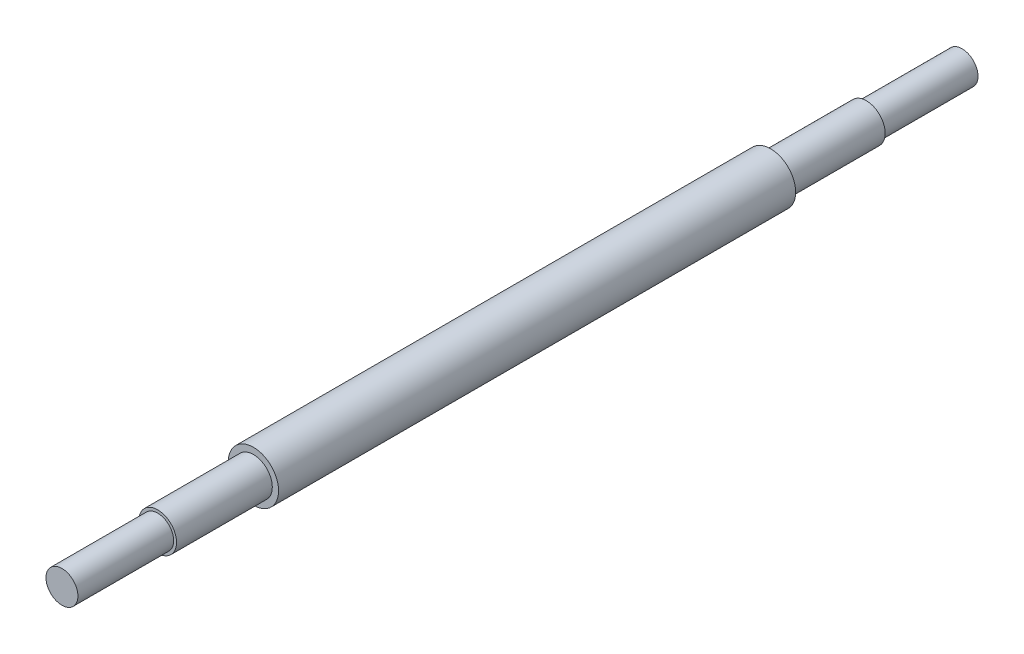
ISO-10303-21;
HEADER;
FILE_DESCRIPTION(('STEP AP214'),'2;1');
FILE_NAME('part.step','',(''),(''),'','','');
FILE_SCHEMA(('AUTOMOTIVE_DESIGN { 1 0 10303 214 1 1 1 1 }'));
ENDSEC;
DATA;
#1=APPLICATION_CONTEXT('core data for automotive mechanical design processes');
#2=APPLICATION_PROTOCOL_DEFINITION('international standard','automotive_design',2000,#1);
#3=PRODUCT_CONTEXT('',#1,'mechanical');
#4=PRODUCT('Part','Part','',(#3));
#5=PRODUCT_RELATED_PRODUCT_CATEGORY('part','',(#4));
#6=PRODUCT_DEFINITION_FORMATION('','',#4);
#7=PRODUCT_DEFINITION_CONTEXT('part definition',#1,'design');
#8=PRODUCT_DEFINITION('design','',#6,#7);
#9=PRODUCT_DEFINITION_SHAPE('','',#8);
#10=(LENGTH_UNIT() NAMED_UNIT(*) SI_UNIT(.MILLI.,.METRE.));
#11=(NAMED_UNIT(*) PLANE_ANGLE_UNIT() SI_UNIT($,.RADIAN.));
#12=(NAMED_UNIT(*) SI_UNIT($,.STERADIAN.) SOLID_ANGLE_UNIT());
#13=UNCERTAINTY_MEASURE_WITH_UNIT(LENGTH_MEASURE(1.E-05),#10,'distance_accuracy_value','');
#14=(GEOMETRIC_REPRESENTATION_CONTEXT(3) GLOBAL_UNCERTAINTY_ASSIGNED_CONTEXT((#13)) GLOBAL_UNIT_ASSIGNED_CONTEXT((#10,
#11,#12)) REPRESENTATION_CONTEXT('',''));
#15=CARTESIAN_POINT('',(0.,0.,0.));
#16=DIRECTION('',(0.,0.,1.));
#17=DIRECTION('',(1.,0.,0.));
#18=AXIS2_PLACEMENT_3D('',#15,#16,#17);
#19=CARTESIAN_POINT('',(0.,0.,-411.48));
#20=DIRECTION('',(0.,0.,1.));
#21=DIRECTION('',(1.,0.,0.));
#22=AXIS2_PLACEMENT_3D('',#19,#20,#21);
#23=CYLINDRICAL_SURFACE('',#22,20.);
#24=CARTESIAN_POINT('',(0.,0.,-411.48));
#25=DIRECTION('',(0.,0.,1.));
#26=DIRECTION('',(1.,0.,0.));
#27=AXIS2_PLACEMENT_3D('',#24,#25,#26);
#28=CIRCLE('',#27,20.);
#29=CARTESIAN_POINT('',(20.,0.,-411.48));
#30=VERTEX_POINT('',#29);
#31=EDGE_CURVE('E66',#30,#30,#28,.T.);
#32=ORIENTED_EDGE('',*,*,#31,.T.);
#33=EDGE_LOOP('',(#32));
#34=FACE_BOUND('',#33,.T.);
#35=CARTESIAN_POINT('',(0.,0.,0.));
#36=DIRECTION('',(0.,0.,1.));
#37=DIRECTION('',(1.,0.,0.));
#38=AXIS2_PLACEMENT_3D('',#35,#36,#37);
#39=CIRCLE('',#38,20.);
#40=CARTESIAN_POINT('',(20.,0.,0.));
#41=VERTEX_POINT('',#40);
#42=EDGE_CURVE('E39',#41,#41,#39,.T.);
#43=ORIENTED_EDGE('',*,*,#42,.F.);
#44=EDGE_LOOP('',(#43));
#45=FACE_BOUND('',#44,.T.);
#46=ADVANCED_FACE('F36',(#34,#45),#23,.T.);
#47=CARTESIAN_POINT('',(0.,0.,-411.48));
#48=DIRECTION('',(0.,0.,1.));
#49=DIRECTION('',(1.,0.,0.));
#50=AXIS2_PLACEMENT_3D('',#47,#48,#49);
#51=PLANE('',#50);
#52=CARTESIAN_POINT('',(0.,0.,-411.48));
#53=DIRECTION('',(0.,0.,-1.));
#54=DIRECTION('',(-1.,0.,0.));
#55=AXIS2_PLACEMENT_3D('',#52,#53,#54);
#56=CIRCLE('',#55,15.);
#57=CARTESIAN_POINT('',(-15.,0.,-411.48));
#58=VERTEX_POINT('',#57);
#59=EDGE_CURVE('E48',#58,#58,#56,.T.);
#60=ORIENTED_EDGE('',*,*,#59,.F.);
#61=EDGE_LOOP('',(#60));
#62=FACE_BOUND('',#61,.T.);
#63=ORIENTED_EDGE('',*,*,#31,.F.);
#64=EDGE_LOOP('',(#63));
#65=FACE_BOUND('',#64,.T.);
#66=ADVANCED_FACE('F76',(#62,#65),#51,.F.);
#67=CARTESIAN_POINT('',(0.,0.,0.));
#68=DIRECTION('',(0.,0.,1.));
#69=DIRECTION('',(1.,0.,0.));
#70=AXIS2_PLACEMENT_3D('',#67,#68,#69);
#71=PLANE('',#70);
#72=CARTESIAN_POINT('',(0.,0.,0.));
#73=DIRECTION('',(0.,0.,1.));
#74=DIRECTION('',(1.,0.,0.));
#75=AXIS2_PLACEMENT_3D('',#72,#73,#74);
#76=CIRCLE('',#75,15.);
#77=CARTESIAN_POINT('',(15.,0.,0.));
#78=VERTEX_POINT('',#77);
#79=EDGE_CURVE('E62',#78,#78,#76,.T.);
#80=ORIENTED_EDGE('',*,*,#79,.F.);
#81=EDGE_LOOP('',(#80));
#82=FACE_BOUND('',#81,.T.);
#83=ORIENTED_EDGE('',*,*,#42,.T.);
#84=EDGE_LOOP('',(#83));
#85=FACE_BOUND('',#84,.T.);
#86=ADVANCED_FACE('F73',(#82,#85),#71,.T.);
#87=CARTESIAN_POINT('',(0.,0.,76.2));
#88=DIRECTION('',(0.,0.,-1.));
#89=DIRECTION('',(-1.,0.,0.));
#90=AXIS2_PLACEMENT_3D('',#87,#88,#89);
#91=CYLINDRICAL_SURFACE('',#90,15.);
#92=CARTESIAN_POINT('',(0.,0.,76.2));
#93=DIRECTION('',(0.,0.,1.));
#94=DIRECTION('',(1.,0.,0.));
#95=AXIS2_PLACEMENT_3D('',#92,#93,#94);
#96=CIRCLE('',#95,15.);
#97=CARTESIAN_POINT('',(15.,0.,76.2));
#98=VERTEX_POINT('',#97);
#99=EDGE_CURVE('E59',#98,#98,#96,.T.);
#100=ORIENTED_EDGE('',*,*,#99,.F.);
#101=EDGE_LOOP('',(#100));
#102=FACE_BOUND('',#101,.T.);
#103=ORIENTED_EDGE('',*,*,#79,.T.);
#104=EDGE_LOOP('',(#103));
#105=FACE_BOUND('',#104,.T.);
#106=ADVANCED_FACE('F85',(#102,#105),#91,.T.);
#107=CARTESIAN_POINT('',(0.,0.,76.2));
#108=DIRECTION('',(0.,0.,1.));
#109=DIRECTION('',(1.,0.,0.));
#110=AXIS2_PLACEMENT_3D('',#107,#108,#109);
#111=PLANE('',#110);
#112=CARTESIAN_POINT('',(0.,0.,76.2));
#113=DIRECTION('',(0.,0.,1.));
#114=DIRECTION('',(1.,0.,0.));
#115=AXIS2_PLACEMENT_3D('',#112,#113,#114);
#116=CIRCLE('',#115,12.7);
#117=CARTESIAN_POINT('',(12.7,0.,76.2));
#118=VERTEX_POINT('',#117);
#119=EDGE_CURVE('E43',#118,#118,#116,.T.);
#120=ORIENTED_EDGE('',*,*,#119,.F.);
#121=EDGE_LOOP('',(#120));
#122=FACE_BOUND('',#121,.T.);
#123=ORIENTED_EDGE('',*,*,#99,.T.);
#124=EDGE_LOOP('',(#123));
#125=FACE_BOUND('',#124,.T.);
#126=ADVANCED_FACE('F92',(#122,#125),#111,.T.);
#127=CARTESIAN_POINT('',(0.,0.,-487.68));
#128=DIRECTION('',(0.,0.,1.));
#129=DIRECTION('',(1.,0.,0.));
#130=AXIS2_PLACEMENT_3D('',#127,#128,#129);
#131=CYLINDRICAL_SURFACE('',#130,15.);
#132=CARTESIAN_POINT('',(0.,0.,-487.68));
#133=DIRECTION('',(0.,0.,-1.));
#134=DIRECTION('',(-1.,0.,0.));
#135=AXIS2_PLACEMENT_3D('',#132,#133,#134);
#136=CIRCLE('',#135,15.);
#137=CARTESIAN_POINT('',(-15.,0.,-487.68));
#138=VERTEX_POINT('',#137);
#139=EDGE_CURVE('E55',#138,#138,#136,.T.);
#140=ORIENTED_EDGE('',*,*,#139,.F.);
#141=EDGE_LOOP('',(#140));
#142=FACE_BOUND('',#141,.T.);
#143=ORIENTED_EDGE('',*,*,#59,.T.);
#144=EDGE_LOOP('',(#143));
#145=FACE_BOUND('',#144,.T.);
#146=ADVANCED_FACE('F96',(#142,#145),#131,.T.);
#147=CARTESIAN_POINT('',(0.,0.,-487.68));
#148=DIRECTION('',(0.,0.,-1.));
#149=DIRECTION('',(-1.,0.,0.));
#150=AXIS2_PLACEMENT_3D('',#147,#148,#149);
#151=PLANE('',#150);
#152=CARTESIAN_POINT('',(0.,0.,-487.68));
#153=DIRECTION('',(0.,0.,-1.));
#154=DIRECTION('',(-1.,0.,0.));
#155=AXIS2_PLACEMENT_3D('',#152,#153,#154);
#156=CIRCLE('',#155,12.7);
#157=CARTESIAN_POINT('',(-12.7,0.,-487.68));
#158=VERTEX_POINT('',#157);
#159=EDGE_CURVE('E10',#158,#158,#156,.T.);
#160=ORIENTED_EDGE('',*,*,#159,.F.);
#161=EDGE_LOOP('',(#160));
#162=FACE_BOUND('',#161,.T.);
#163=ORIENTED_EDGE('',*,*,#139,.T.);
#164=EDGE_LOOP('',(#163));
#165=FACE_BOUND('',#164,.T.);
#166=ADVANCED_FACE('F100',(#162,#165),#151,.T.);
#167=CARTESIAN_POINT('',(0.,0.,152.4));
#168=DIRECTION('',(0.,0.,-1.));
#169=DIRECTION('',(-1.,0.,0.));
#170=AXIS2_PLACEMENT_3D('',#167,#168,#169);
#171=CYLINDRICAL_SURFACE('',#170,12.7);
#172=CARTESIAN_POINT('',(0.,0.,152.4));
#173=DIRECTION('',(0.,0.,1.));
#174=DIRECTION('',(1.,0.,0.));
#175=AXIS2_PLACEMENT_3D('',#172,#173,#174);
#176=CIRCLE('',#175,12.7);
#177=CARTESIAN_POINT('',(12.7,0.,152.4));
#178=VERTEX_POINT('',#177);
#179=EDGE_CURVE('E53',#178,#178,#176,.T.);
#180=ORIENTED_EDGE('',*,*,#179,.F.);
#181=EDGE_LOOP('',(#180));
#182=FACE_BOUND('',#181,.T.);
#183=ORIENTED_EDGE('',*,*,#119,.T.);
#184=EDGE_LOOP('',(#183));
#185=FACE_BOUND('',#184,.T.);
#186=ADVANCED_FACE('F104',(#182,#185),#171,.T.);
#187=CARTESIAN_POINT('',(0.,0.,152.4));
#188=DIRECTION('',(0.,0.,1.));
#189=DIRECTION('',(1.,0.,0.));
#190=AXIS2_PLACEMENT_3D('',#187,#188,#189);
#191=PLANE('',#190);
#192=ORIENTED_EDGE('',*,*,#179,.T.);
#193=EDGE_LOOP('',(#192));
#194=FACE_BOUND('',#193,.T.);
#195=ADVANCED_FACE('F108',(#194),#191,.T.);
#196=CARTESIAN_POINT('',(0.,0.,-563.88));
#197=DIRECTION('',(0.,0.,1.));
#198=DIRECTION('',(1.,0.,0.));
#199=AXIS2_PLACEMENT_3D('',#196,#197,#198);
#200=CYLINDRICAL_SURFACE('',#199,12.7);
#201=CARTESIAN_POINT('',(0.,0.,-563.88));
#202=DIRECTION('',(0.,0.,-1.));
#203=DIRECTION('',(-1.,0.,0.));
#204=AXIS2_PLACEMENT_3D('',#201,#202,#203);
#205=CIRCLE('',#204,12.7);
#206=CARTESIAN_POINT('',(-12.7,0.,-563.88));
#207=VERTEX_POINT('',#206);
#208=EDGE_CURVE('E52',#207,#207,#205,.T.);
#209=ORIENTED_EDGE('',*,*,#208,.F.);
#210=EDGE_LOOP('',(#209));
#211=FACE_BOUND('',#210,.T.);
#212=ORIENTED_EDGE('',*,*,#159,.T.);
#213=EDGE_LOOP('',(#212));
#214=FACE_BOUND('',#213,.T.);
#215=ADVANCED_FACE('F112',(#211,#214),#200,.T.);
#216=CARTESIAN_POINT('',(0.,0.,-563.88));
#217=DIRECTION('',(0.,0.,-1.));
#218=DIRECTION('',(-1.,0.,0.));
#219=AXIS2_PLACEMENT_3D('',#216,#217,#218);
#220=PLANE('',#219);
#221=ORIENTED_EDGE('',*,*,#208,.T.);
#222=EDGE_LOOP('',(#221));
#223=FACE_BOUND('',#222,.T.);
#224=ADVANCED_FACE('F116',(#223),#220,.T.);
#225=CLOSED_SHELL('',(#46,#66,#86,#106,#126,#146,#166,#186,#195,#215,#224));
#226=MANIFOLD_SOLID_BREP('B2',#225);
#227=ADVANCED_BREP_SHAPE_REPRESENTATION('',(#18,#226),#14);
#228=SHAPE_DEFINITION_REPRESENTATION(#9,#227);
ENDSEC;
END-ISO-10303-21;
